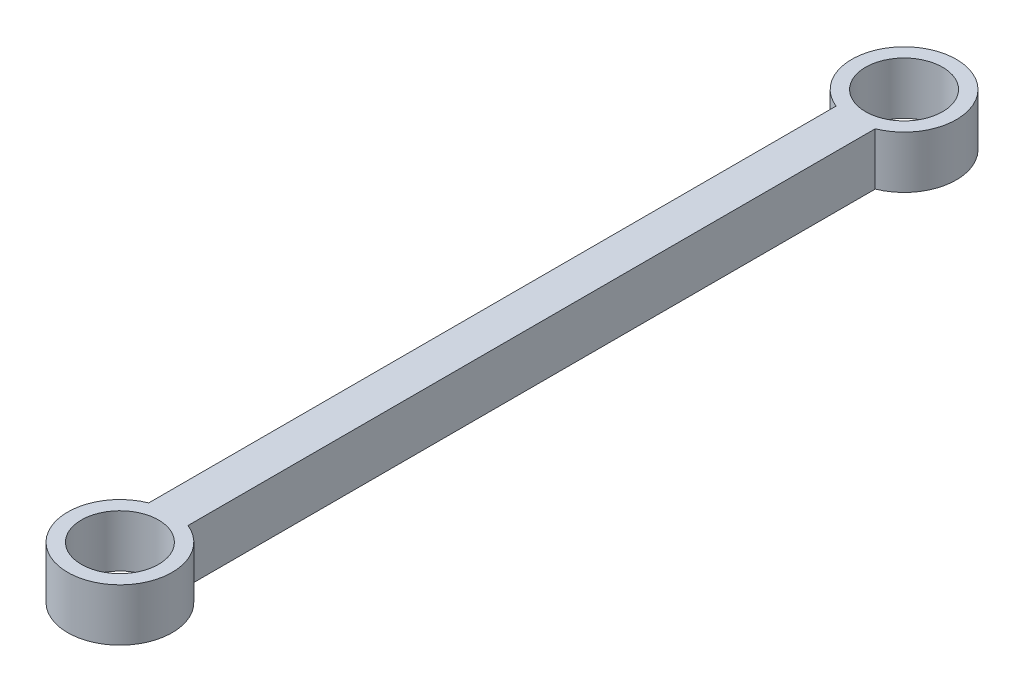
ISO-10303-21;
HEADER;
FILE_DESCRIPTION(('STEP AP214'),'2;1');
FILE_NAME('part.step','',(''),(''),'','','');
FILE_SCHEMA(('AUTOMOTIVE_DESIGN { 1 0 10303 214 1 1 1 1 }'));
ENDSEC;
DATA;
#1=APPLICATION_CONTEXT('core data for automotive mechanical design processes');
#2=APPLICATION_PROTOCOL_DEFINITION('international standard','automotive_design',2000,#1);
#3=PRODUCT_CONTEXT('',#1,'mechanical');
#4=PRODUCT('Part','Part','',(#3));
#5=PRODUCT_RELATED_PRODUCT_CATEGORY('part','',(#4));
#6=PRODUCT_DEFINITION_FORMATION('','',#4);
#7=PRODUCT_DEFINITION_CONTEXT('part definition',#1,'design');
#8=PRODUCT_DEFINITION('design','',#6,#7);
#9=PRODUCT_DEFINITION_SHAPE('','',#8);
#10=(LENGTH_UNIT() NAMED_UNIT(*) SI_UNIT(.MILLI.,.METRE.));
#11=(NAMED_UNIT(*) PLANE_ANGLE_UNIT() SI_UNIT($,.RADIAN.));
#12=(NAMED_UNIT(*) SI_UNIT($,.STERADIAN.) SOLID_ANGLE_UNIT());
#13=UNCERTAINTY_MEASURE_WITH_UNIT(LENGTH_MEASURE(1.E-05),#10,'distance_accuracy_value','');
#14=(GEOMETRIC_REPRESENTATION_CONTEXT(3) GLOBAL_UNCERTAINTY_ASSIGNED_CONTEXT((#13)) GLOBAL_UNIT_ASSIGNED_CONTEXT((#10,
#11,#12)) REPRESENTATION_CONTEXT('',''));
#15=CARTESIAN_POINT('',(0.,0.,0.));
#16=DIRECTION('',(0.,0.,1.));
#17=DIRECTION('',(1.,0.,0.));
#18=AXIS2_PLACEMENT_3D('',#15,#16,#17);
#19=CARTESIAN_POINT('',(0.,4.,-60.));
#20=DIRECTION('',(0.,1.,0.));
#21=DIRECTION('',(0.,0.,1.));
#22=AXIS2_PLACEMENT_3D('',#19,#20,#21);
#23=PLANE('',#22);
#24=CARTESIAN_POINT('',(0.,4.,-60.));
#25=DIRECTION('',(0.,1.,0.));
#26=DIRECTION('',(0.,0.,1.));
#27=AXIS2_PLACEMENT_3D('',#24,#25,#26);
#28=CIRCLE('',#27,2.95);
#29=CARTESIAN_POINT('',(0.,4.,-57.05));
#30=VERTEX_POINT('',#29);
#31=EDGE_CURVE('E112',#30,#30,#28,.T.);
#32=ORIENTED_EDGE('',*,*,#31,.F.);
#33=EDGE_LOOP('',(#32));
#34=FACE_BOUND('',#33,.T.);
#35=CARTESIAN_POINT('',(0.,4.,-60.));
#36=DIRECTION('',(0.,1.,0.));
#37=DIRECTION('',(0.,0.,1.));
#38=AXIS2_PLACEMENT_3D('',#35,#36,#37);
#39=CIRCLE('',#38,4.);
#40=CARTESIAN_POINT('',(1.5,4.,-56.2919007564522));
#41=VERTEX_POINT('',#40);
#42=CARTESIAN_POINT('',(-1.5,4.,-56.2919007564522));
#43=VERTEX_POINT('',#42);
#44=EDGE_CURVE('E92',#41,#43,#39,.T.);
#45=ORIENTED_EDGE('',*,*,#44,.T.);
#46=DIRECTION('',(0.,0.,1.));
#47=VECTOR('',#46,1.);
#48=CARTESIAN_POINT('',(-1.5,4.,-56.2919007564522));
#49=LINE('',#48,#47);
#50=CARTESIAN_POINT('',(-1.49999999999999,4.,-3.70809924354783));
#51=VERTEX_POINT('',#50);
#52=EDGE_CURVE('E87',#43,#51,#49,.T.);
#53=ORIENTED_EDGE('',*,*,#52,.T.);
#54=CARTESIAN_POINT('',(0.,4.,0.));
#55=DIRECTION('',(0.,1.,0.));
#56=DIRECTION('',(0.,0.,1.));
#57=AXIS2_PLACEMENT_3D('',#54,#55,#56);
#58=CIRCLE('',#57,4.);
#59=CARTESIAN_POINT('',(1.5,4.,-3.70809924354783));
#60=VERTEX_POINT('',#59);
#61=EDGE_CURVE('E90',#51,#60,#58,.T.);
#62=ORIENTED_EDGE('',*,*,#61,.T.);
#63=DIRECTION('',(0.,0.,-1.));
#64=VECTOR('',#63,1.);
#65=CARTESIAN_POINT('',(1.5,4.,-56.2919007564522));
#66=LINE('',#65,#64);
#67=EDGE_CURVE('E57',#60,#41,#66,.T.);
#68=ORIENTED_EDGE('',*,*,#67,.T.);
#69=EDGE_LOOP('',(#45,#53,#62,#68));
#70=FACE_BOUND('',#69,.T.);
#71=CARTESIAN_POINT('',(0.,4.,0.));
#72=DIRECTION('',(0.,1.,0.));
#73=DIRECTION('',(0.,0.,1.));
#74=AXIS2_PLACEMENT_3D('',#71,#72,#73);
#75=CIRCLE('',#74,2.95);
#76=CARTESIAN_POINT('',(0.,4.,2.95));
#77=VERTEX_POINT('',#76);
#78=EDGE_CURVE('E134',#77,#77,#75,.T.);
#79=ORIENTED_EDGE('',*,*,#78,.F.);
#80=EDGE_LOOP('',(#79));
#81=FACE_BOUND('',#80,.T.);
#82=ADVANCED_FACE('F39',(#34,#70,#81),#23,.T.);
#83=CARTESIAN_POINT('',(0.,0.,-60.));
#84=DIRECTION('',(0.,1.,0.));
#85=DIRECTION('',(0.,0.,1.));
#86=AXIS2_PLACEMENT_3D('',#83,#84,#85);
#87=PLANE('',#86);
#88=CARTESIAN_POINT('',(0.,0.,-60.));
#89=DIRECTION('',(0.,1.,0.));
#90=DIRECTION('',(0.,0.,1.));
#91=AXIS2_PLACEMENT_3D('',#88,#89,#90);
#92=CIRCLE('',#91,4.);
#93=CARTESIAN_POINT('',(1.5,0.,-56.2919007564522));
#94=VERTEX_POINT('',#93);
#95=CARTESIAN_POINT('',(-1.5,0.,-56.2919007564522));
#96=VERTEX_POINT('',#95);
#97=EDGE_CURVE('E108',#94,#96,#92,.T.);
#98=ORIENTED_EDGE('',*,*,#97,.F.);
#99=DIRECTION('',(0.,0.,-1.));
#100=VECTOR('',#99,1.);
#101=CARTESIAN_POINT('',(1.5,0.,-56.2919007564522));
#102=LINE('',#101,#100);
#103=CARTESIAN_POINT('',(1.5,0.,-3.70809924354783));
#104=VERTEX_POINT('',#103);
#105=EDGE_CURVE('E80',#104,#94,#102,.T.);
#106=ORIENTED_EDGE('',*,*,#105,.F.);
#107=CARTESIAN_POINT('',(0.,0.,0.));
#108=DIRECTION('',(0.,1.,0.));
#109=DIRECTION('',(0.,0.,1.));
#110=AXIS2_PLACEMENT_3D('',#107,#108,#109);
#111=CIRCLE('',#110,4.);
#112=CARTESIAN_POINT('',(-1.49999999999999,0.,-3.70809924354783));
#113=VERTEX_POINT('',#112);
#114=EDGE_CURVE('E74',#113,#104,#111,.T.);
#115=ORIENTED_EDGE('',*,*,#114,.F.);
#116=DIRECTION('',(0.,0.,1.));
#117=VECTOR('',#116,1.);
#118=CARTESIAN_POINT('',(-1.5,0.,-56.2919007564522));
#119=LINE('',#118,#117);
#120=EDGE_CURVE('E97',#96,#113,#119,.T.);
#121=ORIENTED_EDGE('',*,*,#120,.F.);
#122=EDGE_LOOP('',(#98,#106,#115,#121));
#123=FACE_BOUND('',#122,.T.);
#124=CARTESIAN_POINT('',(0.,0.,-60.));
#125=DIRECTION('',(0.,1.,0.));
#126=DIRECTION('',(0.,0.,1.));
#127=AXIS2_PLACEMENT_3D('',#124,#125,#126);
#128=CIRCLE('',#127,2.95);
#129=CARTESIAN_POINT('',(0.,0.,-57.05));
#130=VERTEX_POINT('',#129);
#131=EDGE_CURVE('E130',#130,#130,#128,.T.);
#132=ORIENTED_EDGE('',*,*,#131,.T.);
#133=EDGE_LOOP('',(#132));
#134=FACE_BOUND('',#133,.T.);
#135=CARTESIAN_POINT('',(0.,0.,0.));
#136=DIRECTION('',(0.,1.,0.));
#137=DIRECTION('',(0.,0.,1.));
#138=AXIS2_PLACEMENT_3D('',#135,#136,#137);
#139=CIRCLE('',#138,2.95);
#140=CARTESIAN_POINT('',(0.,0.,2.95));
#141=VERTEX_POINT('',#140);
#142=EDGE_CURVE('E138',#141,#141,#139,.T.);
#143=ORIENTED_EDGE('',*,*,#142,.T.);
#144=EDGE_LOOP('',(#143));
#145=FACE_BOUND('',#144,.T.);
#146=ADVANCED_FACE('F125',(#123,#134,#145),#87,.F.);
#147=CARTESIAN_POINT('',(0.,4.,-60.));
#148=DIRECTION('',(0.,-1.,0.));
#149=DIRECTION('',(0.,0.,-1.));
#150=AXIS2_PLACEMENT_3D('',#147,#148,#149);
#151=CYLINDRICAL_SURFACE('',#150,4.);
#152=ORIENTED_EDGE('',*,*,#97,.T.);
#153=DIRECTION('',(0.,-1.,0.));
#154=VECTOR('',#153,1.);
#155=CARTESIAN_POINT('',(-1.5,4.,-56.2919007564522));
#156=LINE('',#155,#154);
#157=EDGE_CURVE('E11',#43,#96,#156,.T.);
#158=ORIENTED_EDGE('',*,*,#157,.F.);
#159=ORIENTED_EDGE('',*,*,#44,.F.);
#160=DIRECTION('',(0.,-1.,0.));
#161=VECTOR('',#160,1.);
#162=CARTESIAN_POINT('',(1.5,4.,-56.2919007564522));
#163=LINE('',#162,#161);
#164=EDGE_CURVE('E104',#41,#94,#163,.T.);
#165=ORIENTED_EDGE('',*,*,#164,.T.);
#166=EDGE_LOOP('',(#152,#158,#159,#165));
#167=FACE_BOUND('',#166,.T.);
#168=ADVANCED_FACE('F41',(#167),#151,.T.);
#169=CARTESIAN_POINT('',(-1.5,4.,-56.2919007564522));
#170=DIRECTION('',(1.,0.,0.));
#171=DIRECTION('',(0.,0.,-1.));
#172=AXIS2_PLACEMENT_3D('',#169,#170,#171);
#173=PLANE('',#172);
#174=ORIENTED_EDGE('',*,*,#120,.T.);
#175=DIRECTION('',(0.,-1.,0.));
#176=VECTOR('',#175,1.);
#177=CARTESIAN_POINT('',(-1.49999999999999,4.,-3.70809924354783));
#178=LINE('',#177,#176);
#179=EDGE_CURVE('E49',#51,#113,#178,.T.);
#180=ORIENTED_EDGE('',*,*,#179,.F.);
#181=ORIENTED_EDGE('',*,*,#52,.F.);
#182=ORIENTED_EDGE('',*,*,#157,.T.);
#183=EDGE_LOOP('',(#174,#180,#181,#182));
#184=FACE_BOUND('',#183,.T.);
#185=ADVANCED_FACE('F96',(#184),#173,.F.);
#186=CARTESIAN_POINT('',(0.,4.,0.));
#187=DIRECTION('',(0.,-1.,0.));
#188=DIRECTION('',(0.,0.,-1.));
#189=AXIS2_PLACEMENT_3D('',#186,#187,#188);
#190=CYLINDRICAL_SURFACE('',#189,4.);
#191=ORIENTED_EDGE('',*,*,#114,.T.);
#192=DIRECTION('',(0.,-1.,0.));
#193=VECTOR('',#192,1.);
#194=CARTESIAN_POINT('',(1.5,4.,-3.70809924354783));
#195=LINE('',#194,#193);
#196=EDGE_CURVE('E99',#60,#104,#195,.T.);
#197=ORIENTED_EDGE('',*,*,#196,.F.);
#198=ORIENTED_EDGE('',*,*,#61,.F.);
#199=ORIENTED_EDGE('',*,*,#179,.T.);
#200=EDGE_LOOP('',(#191,#197,#198,#199));
#201=FACE_BOUND('',#200,.T.);
#202=ADVANCED_FACE('F100',(#201),#190,.T.);
#203=CARTESIAN_POINT('',(1.5,4.,-56.2919007564522));
#204=DIRECTION('',(-1.,0.,0.));
#205=DIRECTION('',(0.,0.,1.));
#206=AXIS2_PLACEMENT_3D('',#203,#204,#205);
#207=PLANE('',#206);
#208=ORIENTED_EDGE('',*,*,#105,.T.);
#209=ORIENTED_EDGE('',*,*,#164,.F.);
#210=ORIENTED_EDGE('',*,*,#67,.F.);
#211=ORIENTED_EDGE('',*,*,#196,.T.);
#212=EDGE_LOOP('',(#208,#209,#210,#211));
#213=FACE_BOUND('',#212,.T.);
#214=ADVANCED_FACE('F122',(#213),#207,.F.);
#215=CARTESIAN_POINT('',(0.,4.,-60.));
#216=DIRECTION('',(0.,-1.,0.));
#217=DIRECTION('',(0.,0.,-1.));
#218=AXIS2_PLACEMENT_3D('',#215,#216,#217);
#219=CYLINDRICAL_SURFACE('',#218,2.95);
#220=ORIENTED_EDGE('',*,*,#31,.T.);
#221=EDGE_LOOP('',(#220));
#222=FACE_BOUND('',#221,.T.);
#223=ORIENTED_EDGE('',*,*,#131,.F.);
#224=EDGE_LOOP('',(#223));
#225=FACE_BOUND('',#224,.T.);
#226=ADVANCED_FACE('F157',(#222,#225),#219,.F.);
#227=CARTESIAN_POINT('',(0.,4.,0.));
#228=DIRECTION('',(0.,-1.,0.));
#229=DIRECTION('',(0.,0.,-1.));
#230=AXIS2_PLACEMENT_3D('',#227,#228,#229);
#231=CYLINDRICAL_SURFACE('',#230,2.95);
#232=ORIENTED_EDGE('',*,*,#78,.T.);
#233=EDGE_LOOP('',(#232));
#234=FACE_BOUND('',#233,.T.);
#235=ORIENTED_EDGE('',*,*,#142,.F.);
#236=EDGE_LOOP('',(#235));
#237=FACE_BOUND('',#236,.T.);
#238=ADVANCED_FACE('F146',(#234,#237),#231,.F.);
#239=CLOSED_SHELL('',(#82,#146,#168,#185,#202,#214,#226,#238));
#240=MANIFOLD_SOLID_BREP('B2',#239);
#241=ADVANCED_BREP_SHAPE_REPRESENTATION('',(#18,#240),#14);
#242=SHAPE_DEFINITION_REPRESENTATION(#9,#241);
ENDSEC;
END-ISO-10303-21;
